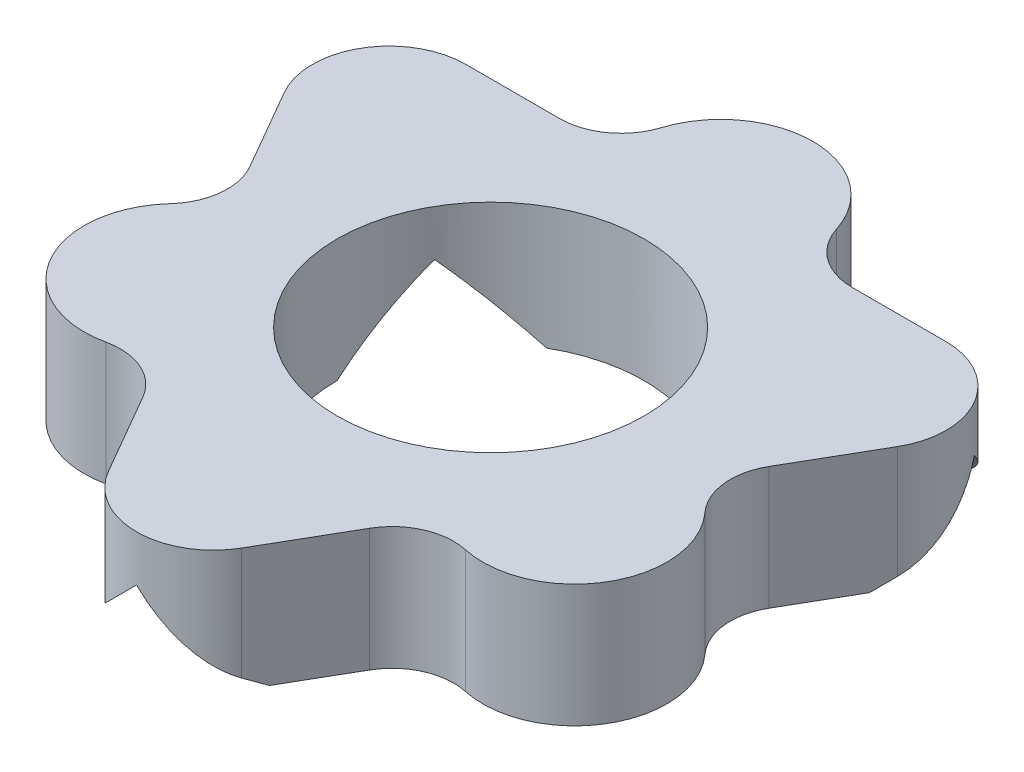
ISO-10303-21;
HEADER;
FILE_DESCRIPTION(('STEP AP214'),'2;1');
FILE_NAME('part.step','',(''),(''),'','','');
FILE_SCHEMA(('AUTOMOTIVE_DESIGN { 1 0 10303 214 1 1 1 1 }'));
ENDSEC;
DATA;
#1=APPLICATION_CONTEXT('core data for automotive mechanical design processes');
#2=APPLICATION_PROTOCOL_DEFINITION('international standard','automotive_design',2000,#1);
#3=PRODUCT_CONTEXT('',#1,'mechanical');
#4=PRODUCT('Part','Part','',(#3));
#5=PRODUCT_RELATED_PRODUCT_CATEGORY('part','',(#4));
#6=PRODUCT_DEFINITION_FORMATION('','',#4);
#7=PRODUCT_DEFINITION_CONTEXT('part definition',#1,'design');
#8=PRODUCT_DEFINITION('design','',#6,#7);
#9=PRODUCT_DEFINITION_SHAPE('','',#8);
#10=(LENGTH_UNIT() NAMED_UNIT(*) SI_UNIT(.MILLI.,.METRE.));
#11=(NAMED_UNIT(*) PLANE_ANGLE_UNIT() SI_UNIT($,.RADIAN.));
#12=(NAMED_UNIT(*) SI_UNIT($,.STERADIAN.) SOLID_ANGLE_UNIT());
#13=UNCERTAINTY_MEASURE_WITH_UNIT(LENGTH_MEASURE(1.E-05),#10,'distance_accuracy_value','');
#14=(GEOMETRIC_REPRESENTATION_CONTEXT(3) GLOBAL_UNCERTAINTY_ASSIGNED_CONTEXT((#13)) GLOBAL_UNIT_ASSIGNED_CONTEXT((#10,
#11,#12)) REPRESENTATION_CONTEXT('',''));
#15=CARTESIAN_POINT('',(0.,0.,0.));
#16=DIRECTION('',(0.,0.,1.));
#17=DIRECTION('',(1.,0.,0.));
#18=AXIS2_PLACEMENT_3D('',#15,#16,#17);
#19=CARTESIAN_POINT('',(11.5265487560121,0.,8.75540769010716));
#20=DIRECTION('',(0.,-1.,0.));
#21=DIRECTION('',(0.,0.,-1.));
#22=AXIS2_PLACEMENT_3D('',#19,#20,#21);
#23=PLANE('',#22);
#24=DIRECTION('',(0.866025403784443,0.,-0.499999999999992));
#25=VECTOR('',#24,1.);
#26=CARTESIAN_POINT('',(1.09904588082542,0.,0.120733384156745));
#27=LINE('',#26,#25);
#28=CARTESIAN_POINT('',(8.59904588082546,0.,-4.20939363476538));
#29=VERTEX_POINT('',#28);
#30=CARTESIAN_POINT('',(13.2540458808258,0.,-6.89695913784322));
#31=VERTEX_POINT('',#30);
#32=EDGE_CURVE('E223',#29,#31,#27,.T.);
#33=ORIENTED_EDGE('',*,*,#32,.F.);
#34=CARTESIAN_POINT('',(6.09904588082545,0.,0.120733384156847));
#35=DIRECTION('',(0.,1.,0.));
#36=DIRECTION('',(0.,0.,1.));
#37=AXIS2_PLACEMENT_3D('',#34,#35,#36);
#38=CIRCLE('',#37,5.00000000000003);
#39=CARTESIAN_POINT('',(3.59904588082543,0.,-4.20939363476537));
#40=VERTEX_POINT('',#39);
#41=EDGE_CURVE('E218',#29,#40,#38,.T.);
#42=ORIENTED_EDGE('',*,*,#41,.T.);
#43=DIRECTION('',(-0.866025403784436,0.,-0.500000000000004));
#44=VECTOR('',#43,1.);
#45=CARTESIAN_POINT('',(11.0990458808255,0.,0.120733384156901));
#46=LINE('',#45,#44);
#47=CARTESIAN_POINT('',(-1.05595411917466,0.,-6.89695913784316));
#48=VERTEX_POINT('',#47);
#49=EDGE_CURVE('E243',#40,#48,#46,.T.);
#50=ORIENTED_EDGE('',*,*,#49,.T.);
#51=DIRECTION('',(-1.,0.,0.));
#52=VECTOR('',#51,1.);
#53=CARTESIAN_POINT('',(1.33495001606111,0.,-6.89695913784322));
#54=LINE('',#53,#52);
#55=CARTESIAN_POINT('',(1.33495001606111,0.,-6.89695913784322));
#56=VERTEX_POINT('',#55);
#57=EDGE_CURVE('E351',#56,#48,#54,.T.);
#58=ORIENTED_EDGE('',*,*,#57,.F.);
#59=CARTESIAN_POINT('',(1.33495001606111,0.,-8.89695913784322));
#60=DIRECTION('',(0.,-1.,0.));
#61=DIRECTION('',(0.,0.,1.));
#62=AXIS2_PLACEMENT_3D('',#59,#60,#61);
#63=CIRCLE('',#62,2.);
#64=CARTESIAN_POINT('',(3.24058836196686,0.,-8.28988212904319));
#65=VERTEX_POINT('',#64);
#66=EDGE_CURVE('E349',#65,#56,#63,.T.);
#67=ORIENTED_EDGE('',*,*,#66,.F.);
#68=CARTESIAN_POINT('',(6.09904588082546,0.,-7.37926661584315));
#69=DIRECTION('',(0.,1.,0.));
#70=DIRECTION('',(0.,0.,-1.));
#71=AXIS2_PLACEMENT_3D('',#68,#69,#70);
#72=CIRCLE('',#71,3.);
#73=CARTESIAN_POINT('',(8.95750339968409,0.,-8.28988212904318));
#74=VERTEX_POINT('',#73);
#75=EDGE_CURVE('E347',#74,#65,#72,.T.);
#76=ORIENTED_EDGE('',*,*,#75,.F.);
#77=CARTESIAN_POINT('',(10.8631417455899,0.,-8.89695913784322));
#78=DIRECTION('',(0.,-1.,0.));
#79=DIRECTION('',(0.,0.,-1.));
#80=AXIS2_PLACEMENT_3D('',#77,#78,#79);
#81=CIRCLE('',#80,2.);
#82=CARTESIAN_POINT('',(10.8631417455899,0.,-6.89695913784322));
#83=VERTEX_POINT('',#82);
#84=EDGE_CURVE('E345',#83,#74,#81,.T.);
#85=ORIENTED_EDGE('',*,*,#84,.F.);
#86=DIRECTION('',(-1.,0.,0.));
#87=VECTOR('',#86,1.);
#88=CARTESIAN_POINT('',(13.9239188619028,0.,-6.89695913784322));
#89=LINE('',#88,#87);
#90=EDGE_CURVE('E343',#31,#83,#89,.T.);
#91=ORIENTED_EDGE('',*,*,#90,.F.);
#92=EDGE_LOOP('',(#33,#42,#50,#58,#67,#76,#85,#91));
#93=FACE_BOUND('',#92,.T.);
#94=ADVANCED_FACE('F31',(#93),#23,.T.);
#95=DIRECTION('',(-0.866025403784436,0.,-0.500000000000004));
#96=VECTOR('',#95,1.);
#97=CARTESIAN_POINT('',(8.59904588082544,0.,4.45086040307909));
#98=LINE('',#97,#96);
#99=CARTESIAN_POINT('',(1.09904588082542,0.,0.12073338415684));
#100=VERTEX_POINT('',#99);
#101=CARTESIAN_POINT('',(-3.55595411917464,0.,-2.56683211892094));
#102=VERTEX_POINT('',#101);
#103=EDGE_CURVE('E245',#100,#102,#98,.T.);
#104=ORIENTED_EDGE('',*,*,#103,.F.);
#105=CARTESIAN_POINT('',(3.59904588082539,0.,4.45086040307904));
#106=VERTEX_POINT('',#105);
#107=EDGE_CURVE('E289',#100,#106,#38,.T.);
#108=ORIENTED_EDGE('',*,*,#107,.T.);
#109=DIRECTION('',(0.,0.,1.));
#110=VECTOR('',#109,1.);
#111=CARTESIAN_POINT('',(3.59904588082539,0.,4.45086040307904));
#112=LINE('',#111,#110);
#113=CARTESIAN_POINT('',(3.59904588082539,0.,9.82599140923434));
#114=VERTEX_POINT('',#113);
#115=EDGE_CURVE('E273',#106,#114,#112,.T.);
#116=ORIENTED_EDGE('',*,*,#115,.T.);
#117=DIRECTION('',(0.500000000000003,0.,0.866025403784437));
#118=VECTOR('',#117,1.);
#119=CARTESIAN_POINT('',(2.40359381320767,0.,7.75540769010721));
#120=LINE('',#119,#118);
#121=CARTESIAN_POINT('',(2.40359381320767,0.,7.75540769010721));
#122=VERTEX_POINT('',#121);
#123=EDGE_CURVE('E362',#122,#114,#120,.T.);
#124=ORIENTED_EDGE('',*,*,#123,.F.);
#125=CARTESIAN_POINT('',(0.671543005638805,0.,8.75540769010719));
#126=DIRECTION('',(0.,-1.,0.));
#127=DIRECTION('',(0.,0.,1.));
#128=AXIS2_PLACEMENT_3D('',#125,#126,#127);
#129=CIRCLE('',#128,1.99999999999998);
#130=CARTESIAN_POINT('',(0.24446794436015,0.,6.80153796772708));
#131=VERTEX_POINT('',#130);
#132=EDGE_CURVE('E360',#131,#122,#129,.T.);
#133=ORIENTED_EDGE('',*,*,#132,.F.);
#134=CARTESIAN_POINT('',(-0.396144647557801,0.,3.87073338415684));
#135=DIRECTION('',(0.,1.,0.));
#136=DIRECTION('',(0.,0.,-1.));
#137=AXIS2_PLACEMENT_3D('',#134,#135,#136);
#138=CIRCLE('',#137,3.00000000000001);
#139=CARTESIAN_POINT('',(-2.61398957449853,0.,1.85054431378662));
#140=VERTEX_POINT('',#139);
#141=EDGE_CURVE('E358',#140,#131,#138,.T.);
#142=ORIENTED_EDGE('',*,*,#141,.F.);
#143=CARTESIAN_POINT('',(-4.09255285912562,0.,0.503751600206422));
#144=DIRECTION('',(0.,-1.,0.));
#145=DIRECTION('',(0.,0.,-1.));
#146=AXIS2_PLACEMENT_3D('',#143,#144,#145);
#147=CIRCLE('',#146,1.99999999999998);
#148=CARTESIAN_POINT('',(-2.36050205155676,0.,-0.496248399793559));
#149=VERTEX_POINT('',#148);
#150=EDGE_CURVE('E356',#149,#140,#147,.T.);
#151=ORIENTED_EDGE('',*,*,#150,.F.);
#152=DIRECTION('',(0.500000000000003,0.,0.866025403784437));
#153=VECTOR('',#152,1.);
#154=CARTESIAN_POINT('',(-3.8908906097135,0.,-3.14695913784305));
#155=LINE('',#154,#153);
#156=EDGE_CURVE('E354',#102,#149,#155,.T.);
#157=ORIENTED_EDGE('',*,*,#156,.F.);
#158=EDGE_LOOP('',(#104,#108,#116,#124,#133,#142,#151,#157));
#159=FACE_BOUND('',#158,.T.);
#160=ADVANCED_FACE('F498',(#159),#23,.T.);
#161=CARTESIAN_POINT('',(11.5265487560121,4.,8.75540769010716));
#162=DIRECTION('',(0.,-1.,0.));
#163=DIRECTION('',(0.,0.,-1.));
#164=AXIS2_PLACEMENT_3D('',#161,#162,#163);
#165=PLANE('',#164);
#166=CARTESIAN_POINT('',(11.5265487560121,4.,8.75540769010716));
#167=DIRECTION('',(0.,-1.,0.));
#168=DIRECTION('',(0.,0.,-1.));
#169=AXIS2_PLACEMENT_3D('',#166,#167,#168);
#170=CIRCLE('',#169,2.00000000000007);
#171=CARTESIAN_POINT('',(9.79449794844297,4.,7.75540769010717));
#172=VERTEX_POINT('',#171);
#173=CARTESIAN_POINT('',(11.9536238172906,4.,6.80153796772693));
#174=VERTEX_POINT('',#173);
#175=EDGE_CURVE('E296',#172,#174,#170,.T.);
#176=ORIENTED_EDGE('',*,*,#175,.T.);
#177=CARTESIAN_POINT('',(12.5942364092088,4.,3.87073338415675));
#178=DIRECTION('',(0.,1.,0.));
#179=DIRECTION('',(0.,0.,-1.));
#180=AXIS2_PLACEMENT_3D('',#177,#178,#179);
#181=CIRCLE('',#180,3.00000000000001);
#182=CARTESIAN_POINT('',(14.8120813361492,4.,1.85054431378651));
#183=VERTEX_POINT('',#182);
#184=EDGE_CURVE('E299',#174,#183,#181,.T.);
#185=ORIENTED_EDGE('',*,*,#184,.T.);
#186=CARTESIAN_POINT('',(16.2906446207765,4.,0.5037516002063));
#187=DIRECTION('',(0.,-1.,0.));
#188=DIRECTION('',(0.,0.,-1.));
#189=AXIS2_PLACEMENT_3D('',#186,#187,#188);
#190=CIRCLE('',#189,2.00000000000014);
#191=CARTESIAN_POINT('',(14.5585938132074,4.,-0.496248399793799));
#192=VERTEX_POINT('',#191);
#193=EDGE_CURVE('E302',#183,#192,#190,.T.);
#194=ORIENTED_EDGE('',*,*,#193,.T.);
#195=DIRECTION('',(0.499999999999995,0.,-0.866025403784442));
#196=VECTOR('',#195,1.);
#197=CARTESIAN_POINT('',(14.5585938132074,4.,-0.496248399793799));
#198=LINE('',#197,#196);
#199=CARTESIAN_POINT('',(16.088982371364,4.,-3.14695913784307));
#200=VERTEX_POINT('',#199);
#201=EDGE_CURVE('E304',#192,#200,#198,.T.);
#202=ORIENTED_EDGE('',*,*,#201,.T.);
#203=CARTESIAN_POINT('',(13.9239188619028,4.,-4.39695913784311));
#204=DIRECTION('',(0.,1.,0.));
#205=DIRECTION('',(0.,0.,-1.));
#206=AXIS2_PLACEMENT_3D('',#203,#204,#205);
#207=CIRCLE('',#206,2.50000000000011);
#208=CARTESIAN_POINT('',(13.9239188619028,4.,-6.89695913784322));
#209=VERTEX_POINT('',#208);
#210=EDGE_CURVE('E306',#200,#209,#207,.T.);
#211=ORIENTED_EDGE('',*,*,#210,.T.);
#212=DIRECTION('',(-1.,0.,0.));
#213=VECTOR('',#212,1.);
#214=CARTESIAN_POINT('',(13.9239188619028,4.,-6.89695913784322));
#215=LINE('',#214,#213);
#216=CARTESIAN_POINT('',(10.8631417455899,4.,-6.89695913784322));
#217=VERTEX_POINT('',#216);
#218=EDGE_CURVE('E308',#209,#217,#215,.T.);
#219=ORIENTED_EDGE('',*,*,#218,.T.);
#220=CARTESIAN_POINT('',(10.8631417455899,4.,-8.89695913784322));
#221=DIRECTION('',(0.,-1.,0.));
#222=DIRECTION('',(0.,0.,-1.));
#223=AXIS2_PLACEMENT_3D('',#220,#221,#222);
#224=CIRCLE('',#223,2.);
#225=CARTESIAN_POINT('',(8.95750339968409,4.,-8.28988212904318));
#226=VERTEX_POINT('',#225);
#227=EDGE_CURVE('E310',#217,#226,#224,.T.);
#228=ORIENTED_EDGE('',*,*,#227,.T.);
#229=CARTESIAN_POINT('',(6.09904588082546,4.,-7.37926661584315));
#230=DIRECTION('',(0.,1.,0.));
#231=DIRECTION('',(0.,0.,-1.));
#232=AXIS2_PLACEMENT_3D('',#229,#230,#231);
#233=CIRCLE('',#232,3.);
#234=CARTESIAN_POINT('',(3.24058836196686,4.,-8.28988212904319));
#235=VERTEX_POINT('',#234);
#236=EDGE_CURVE('E312',#226,#235,#233,.T.);
#237=ORIENTED_EDGE('',*,*,#236,.T.);
#238=CARTESIAN_POINT('',(1.33495001606111,4.,-8.89695913784322));
#239=DIRECTION('',(0.,-1.,0.));
#240=DIRECTION('',(0.,0.,1.));
#241=AXIS2_PLACEMENT_3D('',#238,#239,#240);
#242=CIRCLE('',#241,2.);
#243=CARTESIAN_POINT('',(1.33495001606111,4.,-6.89695913784322));
#244=VERTEX_POINT('',#243);
#245=EDGE_CURVE('E314',#235,#244,#242,.T.);
#246=ORIENTED_EDGE('',*,*,#245,.T.);
#247=DIRECTION('',(-1.,0.,0.));
#248=VECTOR('',#247,1.);
#249=CARTESIAN_POINT('',(1.33495001606111,4.,-6.89695913784322));
#250=LINE('',#249,#248);
#251=CARTESIAN_POINT('',(-1.72582710025211,4.,-6.89695913784318));
#252=VERTEX_POINT('',#251);
#253=EDGE_CURVE('E316',#244,#252,#250,.T.);
#254=ORIENTED_EDGE('',*,*,#253,.T.);
#255=CARTESIAN_POINT('',(-1.72582710025231,4.,-4.39695913784311));
#256=DIRECTION('',(0.,1.,0.));
#257=DIRECTION('',(0.,0.,-1.));
#258=AXIS2_PLACEMENT_3D('',#255,#256,#257);
#259=CIRCLE('',#258,2.50000000000007);
#260=CARTESIAN_POINT('',(-3.8908906097135,4.,-3.14695913784305));
#261=VERTEX_POINT('',#260);
#262=EDGE_CURVE('E318',#252,#261,#259,.T.);
#263=ORIENTED_EDGE('',*,*,#262,.T.);
#264=DIRECTION('',(0.500000000000003,0.,0.866025403784437));
#265=VECTOR('',#264,1.);
#266=CARTESIAN_POINT('',(-3.8908906097135,4.,-3.14695913784305));
#267=LINE('',#266,#265);
#268=CARTESIAN_POINT('',(-2.36050205155676,4.,-0.496248399793559));
#269=VERTEX_POINT('',#268);
#270=EDGE_CURVE('E320',#261,#269,#267,.T.);
#271=ORIENTED_EDGE('',*,*,#270,.T.);
#272=CARTESIAN_POINT('',(-4.09255285912562,4.,0.503751600206422));
#273=DIRECTION('',(0.,-1.,0.));
#274=DIRECTION('',(0.,0.,-1.));
#275=AXIS2_PLACEMENT_3D('',#272,#273,#274);
#276=CIRCLE('',#275,1.99999999999998);
#277=CARTESIAN_POINT('',(-2.61398957449853,4.,1.85054431378662));
#278=VERTEX_POINT('',#277);
#279=EDGE_CURVE('E322',#269,#278,#276,.T.);
#280=ORIENTED_EDGE('',*,*,#279,.T.);
#281=CARTESIAN_POINT('',(-0.396144647557801,4.,3.87073338415684));
#282=DIRECTION('',(0.,1.,0.));
#283=DIRECTION('',(0.,0.,-1.));
#284=AXIS2_PLACEMENT_3D('',#281,#282,#283);
#285=CIRCLE('',#284,3.00000000000001);
#286=CARTESIAN_POINT('',(0.24446794436015,4.,6.80153796772708));
#287=VERTEX_POINT('',#286);
#288=EDGE_CURVE('E324',#278,#287,#285,.T.);
#289=ORIENTED_EDGE('',*,*,#288,.T.);
#290=CARTESIAN_POINT('',(0.671543005638805,4.,8.75540769010719));
#291=DIRECTION('',(0.,-1.,0.));
#292=DIRECTION('',(0.,0.,1.));
#293=AXIS2_PLACEMENT_3D('',#290,#291,#292);
#294=CIRCLE('',#293,1.99999999999998);
#295=CARTESIAN_POINT('',(2.40359381320767,4.,7.75540769010721));
#296=VERTEX_POINT('',#295);
#297=EDGE_CURVE('E326',#287,#296,#294,.T.);
#298=ORIENTED_EDGE('',*,*,#297,.T.);
#299=DIRECTION('',(0.500000000000003,0.,0.866025403784437));
#300=VECTOR('',#299,1.);
#301=CARTESIAN_POINT('',(2.40359381320767,4.,7.75540769010721));
#302=LINE('',#301,#300);
#303=CARTESIAN_POINT('',(3.93398237136423,4.,10.4061184281562));
#304=VERTEX_POINT('',#303);
#305=EDGE_CURVE('E328',#296,#304,#302,.T.);
#306=ORIENTED_EDGE('',*,*,#305,.T.);
#307=CARTESIAN_POINT('',(6.09904588082544,4.,9.15611842815633));
#308=DIRECTION('',(0.,1.,0.));
#309=DIRECTION('',(0.,0.,-1.));
#310=AXIS2_PLACEMENT_3D('',#307,#308,#309);
#311=CIRCLE('',#310,2.50000000000005);
#312=CARTESIAN_POINT('',(8.26410939028653,4.,10.4061184281562));
#313=VERTEX_POINT('',#312);
#314=EDGE_CURVE('E330',#304,#313,#311,.T.);
#315=ORIENTED_EDGE('',*,*,#314,.T.);
#316=DIRECTION('',(0.499999999999995,0.,-0.866025403784441));
#317=VECTOR('',#316,1.);
#318=CARTESIAN_POINT('',(8.26410939028653,4.,10.4061184281562));
#319=LINE('',#318,#317);
#320=EDGE_CURVE('E332',#313,#172,#319,.T.);
#321=ORIENTED_EDGE('',*,*,#320,.T.);
#322=EDGE_LOOP('',(#176,#185,#194,#202,#211,#219,#228,#237,#246,#254,#263,#271,#280,#289,#298,
#306,#315,#321));
#323=FACE_BOUND('',#322,.T.);
#324=CARTESIAN_POINT('',(6.09904588082545,4.,0.120733384156847));
#325=DIRECTION('',(0.,1.,0.));
#326=DIRECTION('',(0.,0.,1.));
#327=AXIS2_PLACEMENT_3D('',#324,#325,#326);
#328=CIRCLE('',#327,5.00000000000003);
#329=CARTESIAN_POINT('',(6.09904588082545,4.,5.12073338415688));
#330=VERTEX_POINT('',#329);
#331=EDGE_CURVE('E290',#330,#330,#328,.T.);
#332=ORIENTED_EDGE('',*,*,#331,.F.);
#333=EDGE_LOOP('',(#332));
#334=FACE_BOUND('',#333,.T.);
#335=ADVANCED_FACE('F463',(#323,#334),#165,.F.);
#336=DIRECTION('',(0.866025403784443,0.,-0.499999999999992));
#337=VECTOR('',#336,1.);
#338=CARTESIAN_POINT('',(3.59904588082536,0.,4.45086040307903));
#339=LINE('',#338,#337);
#340=CARTESIAN_POINT('',(11.0990458808255,0.,0.120733384156824));
#341=VERTEX_POINT('',#340);
#342=CARTESIAN_POINT('',(15.7540458808249,0.,-2.56683211892046));
#343=VERTEX_POINT('',#342);
#344=EDGE_CURVE('E46',#341,#343,#339,.T.);
#345=ORIENTED_EDGE('',*,*,#344,.T.);
#346=DIRECTION('',(0.499999999999995,0.,-0.866025403784442));
#347=VECTOR('',#346,1.);
#348=CARTESIAN_POINT('',(14.5585938132074,0.,-0.496248399793799));
#349=LINE('',#348,#347);
#350=CARTESIAN_POINT('',(14.5585938132074,0.,-0.496248399793799));
#351=VERTEX_POINT('',#350);
#352=EDGE_CURVE('E341',#351,#343,#349,.T.);
#353=ORIENTED_EDGE('',*,*,#352,.F.);
#354=CARTESIAN_POINT('',(16.2906446207765,0.,0.5037516002063));
#355=DIRECTION('',(0.,-1.,0.));
#356=DIRECTION('',(0.,0.,-1.));
#357=AXIS2_PLACEMENT_3D('',#354,#355,#356);
#358=CIRCLE('',#357,2.00000000000014);
#359=CARTESIAN_POINT('',(14.8120813361492,0.,1.85054431378651));
#360=VERTEX_POINT('',#359);
#361=EDGE_CURVE('E339',#360,#351,#358,.T.);
#362=ORIENTED_EDGE('',*,*,#361,.F.);
#363=CARTESIAN_POINT('',(12.5942364092088,0.,3.87073338415675));
#364=DIRECTION('',(0.,1.,0.));
#365=DIRECTION('',(0.,0.,-1.));
#366=AXIS2_PLACEMENT_3D('',#363,#364,#365);
#367=CIRCLE('',#366,3.00000000000001);
#368=CARTESIAN_POINT('',(11.9536238172906,0.,6.80153796772693));
#369=VERTEX_POINT('',#368);
#370=EDGE_CURVE('E337',#369,#360,#367,.T.);
#371=ORIENTED_EDGE('',*,*,#370,.F.);
#372=CARTESIAN_POINT('',(11.5265487560121,0.,8.75540769010716));
#373=DIRECTION('',(0.,-1.,0.));
#374=DIRECTION('',(0.,0.,-1.));
#375=AXIS2_PLACEMENT_3D('',#372,#373,#374);
#376=CIRCLE('',#375,2.00000000000007);
#377=CARTESIAN_POINT('',(9.79449794844297,0.,7.75540769010717));
#378=VERTEX_POINT('',#377);
#379=EDGE_CURVE('E293',#378,#369,#376,.T.);
#380=ORIENTED_EDGE('',*,*,#379,.F.);
#381=DIRECTION('',(0.499999999999995,0.,-0.866025403784441));
#382=VECTOR('',#381,1.);
#383=CARTESIAN_POINT('',(8.26410939028653,0.,10.4061184281562));
#384=LINE('',#383,#382);
#385=CARTESIAN_POINT('',(8.59904588082541,0.,9.82599140923408));
#386=VERTEX_POINT('',#385);
#387=EDGE_CURVE('E300',#386,#378,#384,.T.);
#388=ORIENTED_EDGE('',*,*,#387,.F.);
#389=DIRECTION('',(0.,0.,1.));
#390=VECTOR('',#389,1.);
#391=CARTESIAN_POINT('',(8.59904588082541,0.,4.45086040307911));
#392=LINE('',#391,#390);
#393=CARTESIAN_POINT('',(8.59904588082541,0.,4.4508604030791));
#394=VERTEX_POINT('',#393);
#395=EDGE_CURVE('E264',#394,#386,#392,.T.);
#396=ORIENTED_EDGE('',*,*,#395,.F.);
#397=EDGE_CURVE('E294',#394,#341,#38,.T.);
#398=ORIENTED_EDGE('',*,*,#397,.T.);
#399=EDGE_LOOP('',(#345,#353,#362,#371,#380,#388,#396,#398));
#400=FACE_BOUND('',#399,.T.);
#401=ADVANCED_FACE('F471',(#400),#23,.T.);
#402=CARTESIAN_POINT('',(11.5265487560121,4.,8.75540769010716));
#403=DIRECTION('',(0.,-1.,0.));
#404=DIRECTION('',(0.,0.,-1.));
#405=AXIS2_PLACEMENT_3D('',#402,#403,#404);
#406=CYLINDRICAL_SURFACE('',#405,2.00000000000007);
#407=ORIENTED_EDGE('',*,*,#379,.T.);
#408=DIRECTION('',(0.,-1.,0.));
#409=VECTOR('',#408,1.);
#410=CARTESIAN_POINT('',(11.9536238172906,4.,6.80153796772693));
#411=LINE('',#410,#409);
#412=EDGE_CURVE('E415',#174,#369,#411,.T.);
#413=ORIENTED_EDGE('',*,*,#412,.F.);
#414=ORIENTED_EDGE('',*,*,#175,.F.);
#415=DIRECTION('',(0.,-1.,0.));
#416=VECTOR('',#415,1.);
#417=CARTESIAN_POINT('',(9.79449794844297,4.,7.75540769010717));
#418=LINE('',#417,#416);
#419=EDGE_CURVE('E334',#172,#378,#418,.T.);
#420=ORIENTED_EDGE('',*,*,#419,.T.);
#421=EDGE_LOOP('',(#407,#413,#414,#420));
#422=FACE_BOUND('',#421,.T.);
#423=ADVANCED_FACE('F33',(#422),#406,.F.);
#424=CARTESIAN_POINT('',(12.5942364092088,4.,3.87073338415675));
#425=DIRECTION('',(0.,-1.,0.));
#426=DIRECTION('',(0.,0.,-1.));
#427=AXIS2_PLACEMENT_3D('',#424,#425,#426);
#428=CYLINDRICAL_SURFACE('',#427,3.00000000000001);
#429=ORIENTED_EDGE('',*,*,#370,.T.);
#430=DIRECTION('',(0.,-1.,0.));
#431=VECTOR('',#430,1.);
#432=CARTESIAN_POINT('',(14.8120813361492,4.,1.85054431378651));
#433=LINE('',#432,#431);
#434=EDGE_CURVE('E412',#183,#360,#433,.T.);
#435=ORIENTED_EDGE('',*,*,#434,.F.);
#436=ORIENTED_EDGE('',*,*,#184,.F.);
#437=ORIENTED_EDGE('',*,*,#412,.T.);
#438=EDGE_LOOP('',(#429,#435,#436,#437));
#439=FACE_BOUND('',#438,.T.);
#440=ADVANCED_FACE('F477',(#439),#428,.T.);
#441=CARTESIAN_POINT('',(16.2906446207765,4.,0.5037516002063));
#442=DIRECTION('',(0.,-1.,0.));
#443=DIRECTION('',(0.,0.,-1.));
#444=AXIS2_PLACEMENT_3D('',#441,#442,#443);
#445=CYLINDRICAL_SURFACE('',#444,2.00000000000014);
#446=ORIENTED_EDGE('',*,*,#361,.T.);
#447=DIRECTION('',(0.,-1.,0.));
#448=VECTOR('',#447,1.);
#449=CARTESIAN_POINT('',(14.5585938132074,4.,-0.496248399793799));
#450=LINE('',#449,#448);
#451=EDGE_CURVE('E409',#192,#351,#450,.T.);
#452=ORIENTED_EDGE('',*,*,#451,.F.);
#453=ORIENTED_EDGE('',*,*,#193,.F.);
#454=ORIENTED_EDGE('',*,*,#434,.T.);
#455=EDGE_LOOP('',(#446,#452,#453,#454));
#456=FACE_BOUND('',#455,.T.);
#457=ADVANCED_FACE('F474',(#456),#445,.F.);
#458=CARTESIAN_POINT('',(14.5585938132074,4.,-0.496248399793799));
#459=DIRECTION('',(-0.866025403784442,0.,-0.499999999999995));
#460=DIRECTION('',(-0.499999999999995,0.,0.866025403784442));
#461=AXIS2_PLACEMENT_3D('',#458,#459,#460);
#462=PLANE('',#461);
#463=ORIENTED_EDGE('',*,*,#352,.T.);
#464=DIRECTION('',(0.447213595499949,0.447213595499974,-0.774596669241479));
#465=VECTOR('',#464,1.);
#466=CARTESIAN_POINT('',(15.597684226731,-0.156361654093913,-2.29600578967431));
#467=LINE('',#466,#465);
#468=CARTESIAN_POINT('',(16.088982371364,0.334936490539155,-3.14695913784307));
#469=VERTEX_POINT('',#468);
#470=EDGE_CURVE('E240',#343,#469,#467,.T.);
#471=ORIENTED_EDGE('',*,*,#470,.T.);
#472=DIRECTION('',(0.,-1.,0.));
#473=VECTOR('',#472,1.);
#474=CARTESIAN_POINT('',(16.088982371364,4.,-3.14695913784307));
#475=LINE('',#474,#473);
#476=EDGE_CURVE('E407',#200,#469,#475,.T.);
#477=ORIENTED_EDGE('',*,*,#476,.F.);
#478=ORIENTED_EDGE('',*,*,#201,.F.);
#479=ORIENTED_EDGE('',*,*,#451,.T.);
#480=EDGE_LOOP('',(#463,#471,#477,#478,#479));
#481=FACE_BOUND('',#480,.T.);
#482=ADVANCED_FACE('F469',(#481),#462,.F.);
#483=CARTESIAN_POINT('',(13.9239188619028,4.,-4.39695913784311));
#484=DIRECTION('',(0.,-1.,0.));
#485=DIRECTION('',(0.,0.,-1.));
#486=AXIS2_PLACEMENT_3D('',#483,#484,#485);
#487=CYLINDRICAL_SURFACE('',#486,2.50000000000011);
#488=CARTESIAN_POINT('',(13.9239188619028,2.50000000000037,-4.39695913784311));
#489=DIRECTION('',(0.353553390593271,0.707106781186541,0.612372435695803));
#490=DIRECTION('',(0.353553390593265,-0.707106781186554,0.612372435695792));
#491=AXIS2_PLACEMENT_3D('',#488,#489,#490);
#492=ELLIPSE('',#491,3.53553390593293,2.50000000000011);
#493=CARTESIAN_POINT('',(16.0889823713642,2.5,-5.64695913784283));
#494=VERTEX_POINT('',#493);
#495=EDGE_CURVE('E54',#469,#494,#492,.T.);
#496=ORIENTED_EDGE('',*,*,#495,.T.);
#497=CARTESIAN_POINT('',(13.9239188619028,2.49999999999963,-4.39695913784311));
#498=DIRECTION('',(-0.353553390593264,0.707106781186556,-0.61237243569579));
#499=DIRECTION('',(-0.353553390593273,-0.707106781186539,-0.612372435695806));
#500=AXIS2_PLACEMENT_3D('',#497,#498,#499);
#501=ELLIPSE('',#500,3.53553390593285,2.50000000000011);
#502=CARTESIAN_POINT('',(13.9239188619028,0.33493649053848,-6.89695913784322));
#503=VERTEX_POINT('',#502);
#504=EDGE_CURVE('E232',#494,#503,#501,.T.);
#505=ORIENTED_EDGE('',*,*,#504,.T.);
#506=DIRECTION('',(0.,-1.,0.));
#507=VECTOR('',#506,1.);
#508=CARTESIAN_POINT('',(13.9239188619028,4.,-6.89695913784322));
#509=LINE('',#508,#507);
#510=EDGE_CURVE('E404',#209,#503,#509,.T.);
#511=ORIENTED_EDGE('',*,*,#510,.F.);
#512=ORIENTED_EDGE('',*,*,#210,.F.);
#513=ORIENTED_EDGE('',*,*,#476,.T.);
#514=EDGE_LOOP('',(#496,#505,#511,#512,#513));
#515=FACE_BOUND('',#514,.T.);
#516=ADVANCED_FACE('F460',(#515),#487,.T.);
#517=CARTESIAN_POINT('',(13.9239188619028,4.,-6.89695913784322));
#518=DIRECTION('',(0.,0.,1.));
#519=DIRECTION('',(1.,0.,0.));
#520=AXIS2_PLACEMENT_3D('',#517,#518,#519);
#521=PLANE('',#520);
#522=ORIENTED_EDGE('',*,*,#510,.T.);
#523=DIRECTION('',(-0.894427190999923,-0.447213595499943,0.));
#524=VECTOR('',#523,1.);
#525=CARTESIAN_POINT('',(15.3899442656874,1.06794919243073,-6.89695913784322));
#526=LINE('',#525,#524);
#527=EDGE_CURVE('E222',#503,#31,#526,.T.);
#528=ORIENTED_EDGE('',*,*,#527,.T.);
#529=ORIENTED_EDGE('',*,*,#90,.T.);
#530=DIRECTION('',(0.,-1.,0.));
#531=VECTOR('',#530,1.);
#532=CARTESIAN_POINT('',(10.8631417455899,4.,-6.89695913784322));
#533=LINE('',#532,#531);
#534=EDGE_CURVE('E401',#217,#83,#533,.T.);
#535=ORIENTED_EDGE('',*,*,#534,.F.);
#536=ORIENTED_EDGE('',*,*,#218,.F.);
#537=EDGE_LOOP('',(#522,#528,#529,#535,#536));
#538=FACE_BOUND('',#537,.T.);
#539=ADVANCED_FACE('F457',(#538),#521,.F.);
#540=CARTESIAN_POINT('',(10.8631417455899,4.,-8.89695913784322));
#541=DIRECTION('',(0.,-1.,0.));
#542=DIRECTION('',(0.,0.,-1.));
#543=AXIS2_PLACEMENT_3D('',#540,#541,#542);
#544=CYLINDRICAL_SURFACE('',#543,2.);
#545=ORIENTED_EDGE('',*,*,#84,.T.);
#546=DIRECTION('',(0.,-1.,0.));
#547=VECTOR('',#546,1.);
#548=CARTESIAN_POINT('',(8.95750339968409,4.,-8.28988212904318));
#549=LINE('',#548,#547);
#550=EDGE_CURVE('E398',#226,#74,#549,.T.);
#551=ORIENTED_EDGE('',*,*,#550,.F.);
#552=ORIENTED_EDGE('',*,*,#227,.F.);
#553=ORIENTED_EDGE('',*,*,#534,.T.);
#554=EDGE_LOOP('',(#545,#551,#552,#553));
#555=FACE_BOUND('',#554,.T.);
#556=ADVANCED_FACE('F453',(#555),#544,.F.);
#557=CARTESIAN_POINT('',(6.09904588082546,4.,-7.37926661584315));
#558=DIRECTION('',(0.,-1.,0.));
#559=DIRECTION('',(0.,0.,-1.));
#560=AXIS2_PLACEMENT_3D('',#557,#558,#559);
#561=CYLINDRICAL_SURFACE('',#560,3.);
#562=ORIENTED_EDGE('',*,*,#75,.T.);
#563=DIRECTION('',(0.,-1.,0.));
#564=VECTOR('',#563,1.);
#565=CARTESIAN_POINT('',(3.24058836196686,4.,-8.28988212904319));
#566=LINE('',#565,#564);
#567=EDGE_CURVE('E395',#235,#65,#566,.T.);
#568=ORIENTED_EDGE('',*,*,#567,.F.);
#569=ORIENTED_EDGE('',*,*,#236,.F.);
#570=ORIENTED_EDGE('',*,*,#550,.T.);
#571=EDGE_LOOP('',(#562,#568,#569,#570));
#572=FACE_BOUND('',#571,.T.);
#573=ADVANCED_FACE('F448',(#572),#561,.T.);
#574=CARTESIAN_POINT('',(1.33495001606111,4.,-8.89695913784322));
#575=DIRECTION('',(0.,-1.,0.));
#576=DIRECTION('',(0.,0.,-1.));
#577=AXIS2_PLACEMENT_3D('',#574,#575,#576);
#578=CYLINDRICAL_SURFACE('',#577,2.);
#579=ORIENTED_EDGE('',*,*,#66,.T.);
#580=DIRECTION('',(0.,-1.,0.));
#581=VECTOR('',#580,1.);
#582=CARTESIAN_POINT('',(1.33495001606111,4.,-6.89695913784322));
#583=LINE('',#582,#581);
#584=EDGE_CURVE('E392',#244,#56,#583,.T.);
#585=ORIENTED_EDGE('',*,*,#584,.F.);
#586=ORIENTED_EDGE('',*,*,#245,.F.);
#587=ORIENTED_EDGE('',*,*,#567,.T.);
#588=EDGE_LOOP('',(#579,#585,#586,#587));
#589=FACE_BOUND('',#588,.T.);
#590=ADVANCED_FACE('F442',(#589),#578,.F.);
#591=CARTESIAN_POINT('',(1.33495001606111,4.,-6.89695913784322));
#592=DIRECTION('',(0.,0.,1.));
#593=DIRECTION('',(1.,0.,0.));
#594=AXIS2_PLACEMENT_3D('',#591,#592,#593);
#595=PLANE('',#594);
#596=ORIENTED_EDGE('',*,*,#57,.T.);
#597=DIRECTION('',(-0.894427190999906,0.447213595499978,0.));
#598=VECTOR('',#597,1.);
#599=CARTESIAN_POINT('',(-0.743230810986142,-0.156361654094268,-6.89695913784317));
#600=LINE('',#599,#598);
#601=CARTESIAN_POINT('',(-1.72582710025211,0.334936490538712,-6.89695913784318));
#602=VERTEX_POINT('',#601);
#603=EDGE_CURVE('E252',#48,#602,#600,.T.);
#604=ORIENTED_EDGE('',*,*,#603,.T.);
#605=DIRECTION('',(0.,-1.,0.));
#606=VECTOR('',#605,1.);
#607=CARTESIAN_POINT('',(-1.72582710025211,4.,-6.89695913784318));
#608=LINE('',#607,#606);
#609=EDGE_CURVE('E389',#252,#602,#608,.T.);
#610=ORIENTED_EDGE('',*,*,#609,.F.);
#611=ORIENTED_EDGE('',*,*,#253,.F.);
#612=ORIENTED_EDGE('',*,*,#584,.T.);
#613=EDGE_LOOP('',(#596,#604,#610,#611,#612));
#614=FACE_BOUND('',#613,.T.);
#615=ADVANCED_FACE('F436',(#614),#595,.F.);
#616=CARTESIAN_POINT('',(-1.72582710025231,4.,-4.39695913784311));
#617=DIRECTION('',(0.,-1.,0.));
#618=DIRECTION('',(0.,0.,-1.));
#619=AXIS2_PLACEMENT_3D('',#616,#617,#618);
#620=CYLINDRICAL_SURFACE('',#619,2.50000000000007);
#621=CARTESIAN_POINT('',(-1.72582710025231,2.49999999999997,-4.39695913784311));
#622=DIRECTION('',(0.353553390593277,0.707106781186546,-0.612372435695794));
#623=DIRECTION('',(0.353553390593276,-0.707106781186549,-0.612372435695792));
#624=AXIS2_PLACEMENT_3D('',#621,#622,#623);
#625=ELLIPSE('',#624,3.53553390593285,2.50000000000007);
#626=CARTESIAN_POINT('',(-3.89089060971348,2.5,-5.64695913784313));
#627=VERTEX_POINT('',#626);
#628=EDGE_CURVE('E250',#602,#627,#625,.T.);
#629=ORIENTED_EDGE('',*,*,#628,.T.);
#630=CARTESIAN_POINT('',(-1.72582710025231,2.50000000000003,-4.39695913784311));
#631=DIRECTION('',(-0.353553390593274,0.707106781186552,0.612372435695789));
#632=DIRECTION('',(-0.353553390593279,-0.707106781186543,0.612372435695797));
#633=AXIS2_PLACEMENT_3D('',#630,#631,#632);
#634=ELLIPSE('',#633,3.53553390593282,2.50000000000007);
#635=CARTESIAN_POINT('',(-3.8908906097135,0.33493649053885,-3.14695913784305));
#636=VERTEX_POINT('',#635);
#637=EDGE_CURVE('E256',#627,#636,#634,.T.);
#638=ORIENTED_EDGE('',*,*,#637,.T.);
#639=DIRECTION('',(0.,-1.,0.));
#640=VECTOR('',#639,1.);
#641=CARTESIAN_POINT('',(-3.8908906097135,4.,-3.14695913784305));
#642=LINE('',#641,#640);
#643=EDGE_CURVE('E386',#261,#636,#642,.T.);
#644=ORIENTED_EDGE('',*,*,#643,.F.);
#645=ORIENTED_EDGE('',*,*,#262,.F.);
#646=ORIENTED_EDGE('',*,*,#609,.T.);
#647=EDGE_LOOP('',(#629,#638,#644,#645,#646));
#648=FACE_BOUND('',#647,.T.);
#649=ADVANCED_FACE('F525',(#648),#620,.T.);
#650=CARTESIAN_POINT('',(-3.8908906097135,4.,-3.14695913784305));
#651=DIRECTION('',(0.866025403784437,0.,-0.500000000000003));
#652=DIRECTION('',(-0.500000000000003,0.,-0.866025403784437));
#653=AXIS2_PLACEMENT_3D('',#650,#651,#652);
#654=PLANE('',#653);
#655=ORIENTED_EDGE('',*,*,#643,.T.);
#656=DIRECTION('',(0.447213595499963,-0.447213595499949,0.774596669241486));
#657=VECTOR('',#656,1.);
#658=CARTESIAN_POINT('',(-4.62390331160573,1.06794919243105,-4.41657438011371));
#659=LINE('',#658,#657);
#660=EDGE_CURVE('E254',#636,#102,#659,.T.);
#661=ORIENTED_EDGE('',*,*,#660,.T.);
#662=ORIENTED_EDGE('',*,*,#156,.T.);
#663=DIRECTION('',(0.,-1.,0.));
#664=VECTOR('',#663,1.);
#665=CARTESIAN_POINT('',(-2.36050205155676,4.,-0.496248399793559));
#666=LINE('',#665,#664);
#667=EDGE_CURVE('E383',#269,#149,#666,.T.);
#668=ORIENTED_EDGE('',*,*,#667,.F.);
#669=ORIENTED_EDGE('',*,*,#270,.F.);
#670=EDGE_LOOP('',(#655,#661,#662,#668,#669));
#671=FACE_BOUND('',#670,.T.);
#672=ADVANCED_FACE('F522',(#671),#654,.F.);
#673=CARTESIAN_POINT('',(-4.09255285912562,4.,0.503751600206422));
#674=DIRECTION('',(0.,-1.,0.));
#675=DIRECTION('',(0.,0.,-1.));
#676=AXIS2_PLACEMENT_3D('',#673,#674,#675);
#677=CYLINDRICAL_SURFACE('',#676,1.99999999999998);
#678=ORIENTED_EDGE('',*,*,#150,.T.);
#679=DIRECTION('',(0.,-1.,0.));
#680=VECTOR('',#679,1.);
#681=CARTESIAN_POINT('',(-2.61398957449853,4.,1.85054431378662));
#682=LINE('',#681,#680);
#683=EDGE_CURVE('E380',#278,#140,#682,.T.);
#684=ORIENTED_EDGE('',*,*,#683,.F.);
#685=ORIENTED_EDGE('',*,*,#279,.F.);
#686=ORIENTED_EDGE('',*,*,#667,.T.);
#687=EDGE_LOOP('',(#678,#684,#685,#686));
#688=FACE_BOUND('',#687,.T.);
#689=ADVANCED_FACE('F518',(#688),#677,.F.);
#690=CARTESIAN_POINT('',(-0.396144647557801,4.,3.87073338415684));
#691=DIRECTION('',(0.,-1.,0.));
#692=DIRECTION('',(0.,0.,-1.));
#693=AXIS2_PLACEMENT_3D('',#690,#691,#692);
#694=CYLINDRICAL_SURFACE('',#693,3.00000000000001);
#695=ORIENTED_EDGE('',*,*,#141,.T.);
#696=DIRECTION('',(0.,-1.,0.));
#697=VECTOR('',#696,1.);
#698=CARTESIAN_POINT('',(0.24446794436015,4.,6.80153796772708));
#699=LINE('',#698,#697);
#700=EDGE_CURVE('E377',#287,#131,#699,.T.);
#701=ORIENTED_EDGE('',*,*,#700,.F.);
#702=ORIENTED_EDGE('',*,*,#288,.F.);
#703=ORIENTED_EDGE('',*,*,#683,.T.);
#704=EDGE_LOOP('',(#695,#701,#702,#703));
#705=FACE_BOUND('',#704,.T.);
#706=ADVANCED_FACE('F513',(#705),#694,.T.);
#707=CARTESIAN_POINT('',(0.671543005638805,4.,8.75540769010719));
#708=DIRECTION('',(0.,-1.,0.));
#709=DIRECTION('',(0.,0.,-1.));
#710=AXIS2_PLACEMENT_3D('',#707,#708,#709);
#711=CYLINDRICAL_SURFACE('',#710,1.99999999999998);
#712=ORIENTED_EDGE('',*,*,#132,.T.);
#713=DIRECTION('',(0.,-1.,0.));
#714=VECTOR('',#713,1.);
#715=CARTESIAN_POINT('',(2.40359381320767,4.,7.75540769010721));
#716=LINE('',#715,#714);
#717=EDGE_CURVE('E374',#296,#122,#716,.T.);
#718=ORIENTED_EDGE('',*,*,#717,.F.);
#719=ORIENTED_EDGE('',*,*,#297,.F.);
#720=ORIENTED_EDGE('',*,*,#700,.T.);
#721=EDGE_LOOP('',(#712,#718,#719,#720));
#722=FACE_BOUND('',#721,.T.);
#723=ADVANCED_FACE('F507',(#722),#711,.F.);
#724=CARTESIAN_POINT('',(2.40359381320767,4.,7.75540769010721));
#725=DIRECTION('',(0.866025403784437,0.,-0.500000000000003));
#726=DIRECTION('',(-0.500000000000003,0.,-0.866025403784437));
#727=AXIS2_PLACEMENT_3D('',#724,#725,#726);
#728=PLANE('',#727);
#729=ORIENTED_EDGE('',*,*,#123,.T.);
#730=DIRECTION('',(0.44721359549996,0.447213595499961,0.77459666924148));
#731=VECTOR('',#730,1.);
#732=CARTESIAN_POINT('',(3.44268422673123,-0.156361654094161,9.55516507998775));
#733=LINE('',#732,#731);
#734=CARTESIAN_POINT('',(3.93398237136423,0.33493649053884,10.4061184281562));
#735=VERTEX_POINT('',#734);
#736=EDGE_CURVE('E283',#114,#735,#733,.T.);
#737=ORIENTED_EDGE('',*,*,#736,.T.);
#738=DIRECTION('',(0.,-1.,0.));
#739=VECTOR('',#738,1.);
#740=CARTESIAN_POINT('',(3.93398237136423,4.,10.4061184281562));
#741=LINE('',#740,#739);
#742=EDGE_CURVE('E371',#304,#735,#741,.T.);
#743=ORIENTED_EDGE('',*,*,#742,.F.);
#744=ORIENTED_EDGE('',*,*,#305,.F.);
#745=ORIENTED_EDGE('',*,*,#717,.T.);
#746=EDGE_LOOP('',(#729,#737,#743,#744,#745));
#747=FACE_BOUND('',#746,.T.);
#748=ADVANCED_FACE('F501',(#747),#728,.F.);
#749=CARTESIAN_POINT('',(6.09904588082544,4.,9.15611842815633));
#750=DIRECTION('',(0.,-1.,0.));
#751=DIRECTION('',(0.,0.,-1.));
#752=AXIS2_PLACEMENT_3D('',#749,#750,#751);
#753=CYLINDRICAL_SURFACE('',#752,2.50000000000005);
#754=CARTESIAN_POINT('',(6.09904588082544,2.50000000000007,9.15611842815633));
#755=DIRECTION('',(-0.707106781186549,0.707106781186546,0.));
#756=DIRECTION('',(-0.707106781186546,-0.707106781186549,0.));
#757=AXIS2_PLACEMENT_3D('',#754,#755,#756);
#758=ELLIPSE('',#757,3.53553390593281,2.50000000000005);
#759=CARTESIAN_POINT('',(6.09904588082538,2.5,11.6561184281564));
#760=VERTEX_POINT('',#759);
#761=EDGE_CURVE('E263',#735,#760,#758,.T.);
#762=ORIENTED_EDGE('',*,*,#761,.T.);
#763=CARTESIAN_POINT('',(6.09904588082544,2.49999999999994,9.15611842815633));
#764=DIRECTION('',(0.707106781186543,0.707106781186552,0.));
#765=DIRECTION('',(0.707106781186552,-0.707106781186543,0.));
#766=AXIS2_PLACEMENT_3D('',#763,#764,#765);
#767=ELLIPSE('',#766,3.53553390593279,2.50000000000005);
#768=CARTESIAN_POINT('',(8.26410939028653,0.334936490538877,10.4061184281562));
#769=VERTEX_POINT('',#768);
#770=EDGE_CURVE('E287',#760,#769,#767,.T.);
#771=ORIENTED_EDGE('',*,*,#770,.T.);
#772=DIRECTION('',(0.,-1.,0.));
#773=VECTOR('',#772,1.);
#774=CARTESIAN_POINT('',(8.26410939028653,4.,10.4061184281562));
#775=LINE('',#774,#773);
#776=EDGE_CURVE('E368',#313,#769,#775,.T.);
#777=ORIENTED_EDGE('',*,*,#776,.F.);
#778=ORIENTED_EDGE('',*,*,#314,.F.);
#779=ORIENTED_EDGE('',*,*,#742,.T.);
#780=EDGE_LOOP('',(#762,#771,#777,#778,#779));
#781=FACE_BOUND('',#780,.T.);
#782=ADVANCED_FACE('F530',(#781),#753,.T.);
#783=CARTESIAN_POINT('',(8.26410939028653,4.,10.4061184281562));
#784=DIRECTION('',(-0.866025403784441,0.,-0.499999999999995));
#785=DIRECTION('',(-0.499999999999995,0.,0.866025403784442));
#786=AXIS2_PLACEMENT_3D('',#783,#784,#785);
#787=PLANE('',#786);
#788=ORIENTED_EDGE('',*,*,#776,.T.);
#789=DIRECTION('',(0.447213595499956,-0.44721359549995,-0.774596669241489));
#790=VECTOR('',#789,1.);
#791=CARTESIAN_POINT('',(7.53109668839432,1.06794919243108,11.6757336704269));
#792=LINE('',#791,#790);
#793=EDGE_CURVE('E285',#769,#386,#792,.T.);
#794=ORIENTED_EDGE('',*,*,#793,.T.);
#795=ORIENTED_EDGE('',*,*,#387,.T.);
#796=ORIENTED_EDGE('',*,*,#419,.F.);
#797=ORIENTED_EDGE('',*,*,#320,.F.);
#798=EDGE_LOOP('',(#788,#794,#795,#796,#797));
#799=FACE_BOUND('',#798,.T.);
#800=ADVANCED_FACE('F532',(#799),#787,.F.);
#801=CARTESIAN_POINT('',(6.09904588082545,4.,0.120733384156847));
#802=DIRECTION('',(0.,-1.,0.));
#803=DIRECTION('',(0.,0.,-1.));
#804=AXIS2_PLACEMENT_3D('',#801,#802,#803);
#805=CYLINDRICAL_SURFACE('',#804,5.00000000000003);
#806=CARTESIAN_POINT('',(6.09904588082545,2.5,0.120733384156847));
#807=DIRECTION('',(-0.353553390593264,0.707106781186556,-0.61237243569579));
#808=DIRECTION('',(-0.353553390593273,-0.707106781186539,-0.612372435695806));
#809=AXIS2_PLACEMENT_3D('',#806,#807,#808);
#810=ELLIPSE('',#809,7.07106781186543,5.00000000000003);
#811=CARTESIAN_POINT('',(10.4291728997477,2.5,-2.37926661584313));
#812=VERTEX_POINT('',#811);
#813=EDGE_CURVE('E213',#812,#29,#810,.T.);
#814=ORIENTED_EDGE('',*,*,#813,.F.);
#815=CARTESIAN_POINT('',(6.09904588082545,2.5,0.120733384156847));
#816=DIRECTION('',(0.353553390593271,0.707106781186541,0.612372435695803));
#817=DIRECTION('',(0.353553390593265,-0.707106781186554,0.612372435695792));
#818=AXIS2_PLACEMENT_3D('',#815,#816,#817);
#819=ELLIPSE('',#818,7.07106781186559,5.00000000000003);
#820=EDGE_CURVE('E11',#341,#812,#819,.T.);
#821=ORIENTED_EDGE('',*,*,#820,.F.);
#822=ORIENTED_EDGE('',*,*,#397,.F.);
#823=CARTESIAN_POINT('',(8.59904588082541,0.,4.45086040307911));
#824=CARTESIAN_POINT('',(7.83453288834533,0.764512992480068,4.89225218508643));
#825=CARTESIAN_POINT('',(6.98182944484005,1.61721643598534,5.12073338415689));
#826=CARTESIAN_POINT('',(6.09904588082538,2.5,5.12073338415688));
#827=(BOUNDED_CURVE() B_SPLINE_CURVE(3,(#823,#824,#825,#826),.UNSPECIFIED.,.F.,
.F.) B_SPLINE_CURVE_WITH_KNOTS((4,4),(0.,1.),
.UNSPECIFIED.) CURVE() GEOMETRIC_REPRESENTATION_ITEM() RATIONAL_B_SPLINE_CURVE((1.,
0.977283884192712,0.977283884192712,1.)) REPRESENTATION_ITEM(''));
#828=CARTESIAN_POINT('',(6.09904588082538,2.5,5.12073338415688));
#829=VERTEX_POINT('',#828);
#830=EDGE_CURVE('E259',#394,#829,#827,.T.);
#831=ORIENTED_EDGE('',*,*,#830,.T.);
#832=CARTESIAN_POINT('',(6.09904588082538,2.5,5.12073338415688));
#833=CARTESIAN_POINT('',(5.21626231681072,1.61721643598533,5.12073338415687));
#834=CARTESIAN_POINT('',(4.36355887330545,0.764512992480062,4.89225218508638));
#835=CARTESIAN_POINT('',(3.59904588082539,0.,4.45086040307904));
#836=(BOUNDED_CURVE() B_SPLINE_CURVE(3,(#832,#833,#834,#835),.UNSPECIFIED.,.F.,
.F.) B_SPLINE_CURVE_WITH_KNOTS((4,4),(0.,1.),
.UNSPECIFIED.) CURVE() GEOMETRIC_REPRESENTATION_ITEM() RATIONAL_B_SPLINE_CURVE((1.,
0.977283884192713,0.977283884192713,1.)) REPRESENTATION_ITEM(''));
#837=EDGE_CURVE('E265',#829,#106,#836,.T.);
#838=ORIENTED_EDGE('',*,*,#837,.T.);
#839=ORIENTED_EDGE('',*,*,#107,.F.);
#840=CARTESIAN_POINT('',(6.09904588082545,2.5,0.120733384156847));
#841=DIRECTION('',(-0.353553390593274,0.707106781186552,0.612372435695789));
#842=DIRECTION('',(-0.353553390593279,-0.707106781186543,0.612372435695797));
#843=AXIS2_PLACEMENT_3D('',#840,#841,#842);
#844=ELLIPSE('',#843,7.07106781186548,5.00000000000003);
#845=CARTESIAN_POINT('',(1.76891886190325,2.5,-2.37926661584319));
#846=VERTEX_POINT('',#845);
#847=EDGE_CURVE('E39',#846,#100,#844,.T.);
#848=ORIENTED_EDGE('',*,*,#847,.F.);
#849=CARTESIAN_POINT('',(6.09904588082545,2.5,0.120733384156847));
#850=DIRECTION('',(0.353553390593277,0.707106781186546,-0.612372435695794));
#851=DIRECTION('',(0.353553390593276,-0.707106781186549,-0.612372435695792));
#852=AXIS2_PLACEMENT_3D('',#849,#850,#851);
#853=ELLIPSE('',#852,7.07106781186554,5.00000000000003);
#854=EDGE_CURVE('E418',#40,#846,#853,.T.);
#855=ORIENTED_EDGE('',*,*,#854,.F.);
#856=ORIENTED_EDGE('',*,*,#41,.F.);
#857=EDGE_LOOP('',(#814,#821,#822,#831,#838,#839,#848,#855,#856));
#858=FACE_BOUND('',#857,.T.);
#859=ORIENTED_EDGE('',*,*,#331,.T.);
#860=EDGE_LOOP('',(#859));
#861=FACE_BOUND('',#860,.T.);
#862=ADVANCED_FACE('F214',(#858,#861),#805,.F.);
#863=CARTESIAN_POINT('',(6.09904588082538,2.5,5.12073338415688));
#864=DIRECTION('',(0.707106781186543,0.707106781186552,0.));
#865=DIRECTION('',(-0.707106781186552,0.707106781186543,0.));
#866=AXIS2_PLACEMENT_3D('',#863,#864,#865);
#867=PLANE('',#866);
#868=ORIENTED_EDGE('',*,*,#770,.F.);
#869=DIRECTION('',(0.,0.,1.));
#870=VECTOR('',#869,1.);
#871=CARTESIAN_POINT('',(6.09904588082538,2.5,5.12073338415688));
#872=LINE('',#871,#870);
#873=EDGE_CURVE('E258',#829,#760,#872,.T.);
#874=ORIENTED_EDGE('',*,*,#873,.F.);
#875=ORIENTED_EDGE('',*,*,#830,.F.);
#876=ORIENTED_EDGE('',*,*,#395,.T.);
#877=ORIENTED_EDGE('',*,*,#793,.F.);
#878=EDGE_LOOP('',(#868,#874,#875,#876,#877));
#879=FACE_BOUND('',#878,.T.);
#880=ADVANCED_FACE('F488',(#879),#867,.F.);
#881=CARTESIAN_POINT('',(3.59904588082539,0.,4.45086040307904));
#882=DIRECTION('',(-0.707106781186549,0.707106781186546,0.));
#883=DIRECTION('',(-0.707106781186546,-0.707106781186549,0.));
#884=AXIS2_PLACEMENT_3D('',#881,#882,#883);
#885=PLANE('',#884);
#886=ORIENTED_EDGE('',*,*,#736,.F.);
#887=ORIENTED_EDGE('',*,*,#115,.F.);
#888=ORIENTED_EDGE('',*,*,#837,.F.);
#889=ORIENTED_EDGE('',*,*,#873,.T.);
#890=ORIENTED_EDGE('',*,*,#761,.F.);
#891=EDGE_LOOP('',(#886,#887,#888,#889,#890));
#892=FACE_BOUND('',#891,.T.);
#893=ADVANCED_FACE('F494',(#892),#885,.F.);
#894=CARTESIAN_POINT('',(10.4291728997477,2.5,2.62073338415688));
#895=DIRECTION('',(-0.353553390593274,0.707106781186552,0.612372435695789));
#896=DIRECTION('',(0.,-0.654653670707972,0.755928946018459));
#897=AXIS2_PLACEMENT_3D('',#894,#895,#896);
#898=PLANE('',#897);
#899=ORIENTED_EDGE('',*,*,#637,.F.);
#900=DIRECTION('',(-0.866025403784436,0.,-0.500000000000004));
#901=VECTOR('',#900,1.);
#902=CARTESIAN_POINT('',(10.4291728997477,2.5,2.62073338415688));
#903=LINE('',#902,#901);
#904=EDGE_CURVE('E242',#846,#627,#903,.T.);
#905=ORIENTED_EDGE('',*,*,#904,.F.);
#906=ORIENTED_EDGE('',*,*,#847,.T.);
#907=ORIENTED_EDGE('',*,*,#103,.T.);
#908=ORIENTED_EDGE('',*,*,#660,.F.);
#909=EDGE_LOOP('',(#899,#905,#906,#907,#908));
#910=FACE_BOUND('',#909,.T.);
#911=ADVANCED_FACE('F424',(#910),#898,.F.);
#912=CARTESIAN_POINT('',(11.0990458808255,0.,0.120733384156901));
#913=DIRECTION('',(0.353553390593277,0.707106781186546,-0.612372435695794));
#914=DIRECTION('',(0.,0.654653670707978,0.755928946018454));
#915=AXIS2_PLACEMENT_3D('',#912,#913,#914);
#916=PLANE('',#915);
#917=ORIENTED_EDGE('',*,*,#603,.F.);
#918=ORIENTED_EDGE('',*,*,#49,.F.);
#919=ORIENTED_EDGE('',*,*,#854,.T.);
#920=ORIENTED_EDGE('',*,*,#904,.T.);
#921=ORIENTED_EDGE('',*,*,#628,.F.);
#922=EDGE_LOOP('',(#917,#918,#919,#920,#921));
#923=FACE_BOUND('',#922,.T.);
#924=ADVANCED_FACE('F430',(#923),#916,.F.);
#925=CARTESIAN_POINT('',(3.59904588082536,0.,4.45086040307903));
#926=DIRECTION('',(0.353553390593271,0.707106781186541,0.612372435695803));
#927=DIRECTION('',(0.,-0.654653670707986,0.755928946018447));
#928=AXIS2_PLACEMENT_3D('',#925,#926,#927);
#929=PLANE('',#928);
#930=ORIENTED_EDGE('',*,*,#470,.F.);
#931=ORIENTED_EDGE('',*,*,#344,.F.);
#932=ORIENTED_EDGE('',*,*,#820,.T.);
#933=DIRECTION('',(0.866025403784443,0.,-0.499999999999992));
#934=VECTOR('',#933,1.);
#935=CARTESIAN_POINT('',(1.76891886190321,2.5,2.62073338415682));
#936=LINE('',#935,#934);
#937=EDGE_CURVE('E229',#812,#494,#936,.T.);
#938=ORIENTED_EDGE('',*,*,#937,.T.);
#939=ORIENTED_EDGE('',*,*,#495,.F.);
#940=EDGE_LOOP('',(#930,#931,#932,#938,#939));
#941=FACE_BOUND('',#940,.T.);
#942=ADVANCED_FACE('F228',(#941),#929,.F.);
#943=CARTESIAN_POINT('',(1.76891886190321,2.5,2.62073338415682));
#944=DIRECTION('',(-0.353553390593264,0.707106781186556,-0.61237243569579));
#945=DIRECTION('',(0.,0.65465367070797,0.755928946018461));
#946=AXIS2_PLACEMENT_3D('',#943,#944,#945);
#947=PLANE('',#946);
#948=ORIENTED_EDGE('',*,*,#504,.F.);
#949=ORIENTED_EDGE('',*,*,#937,.F.);
#950=ORIENTED_EDGE('',*,*,#813,.T.);
#951=ORIENTED_EDGE('',*,*,#32,.T.);
#952=ORIENTED_EDGE('',*,*,#527,.F.);
#953=EDGE_LOOP('',(#948,#949,#950,#951,#952));
#954=FACE_BOUND('',#953,.T.);
#955=ADVANCED_FACE('F230',(#954),#947,.F.);
#956=CLOSED_SHELL('',(#94,#160,#335,#401,#423,#440,#457,#482,#516,#539,#556,#573,#590,#615,#649,
#672,#689,#706,#723,#748,#782,#800,#862,#880,#893,#911,#924,#942,#955));
#957=MANIFOLD_SOLID_BREP('B2',#956);
#958=ADVANCED_BREP_SHAPE_REPRESENTATION('',(#18,#957),#14);
#959=SHAPE_DEFINITION_REPRESENTATION(#9,#958);
ENDSEC;
END-ISO-10303-21;
